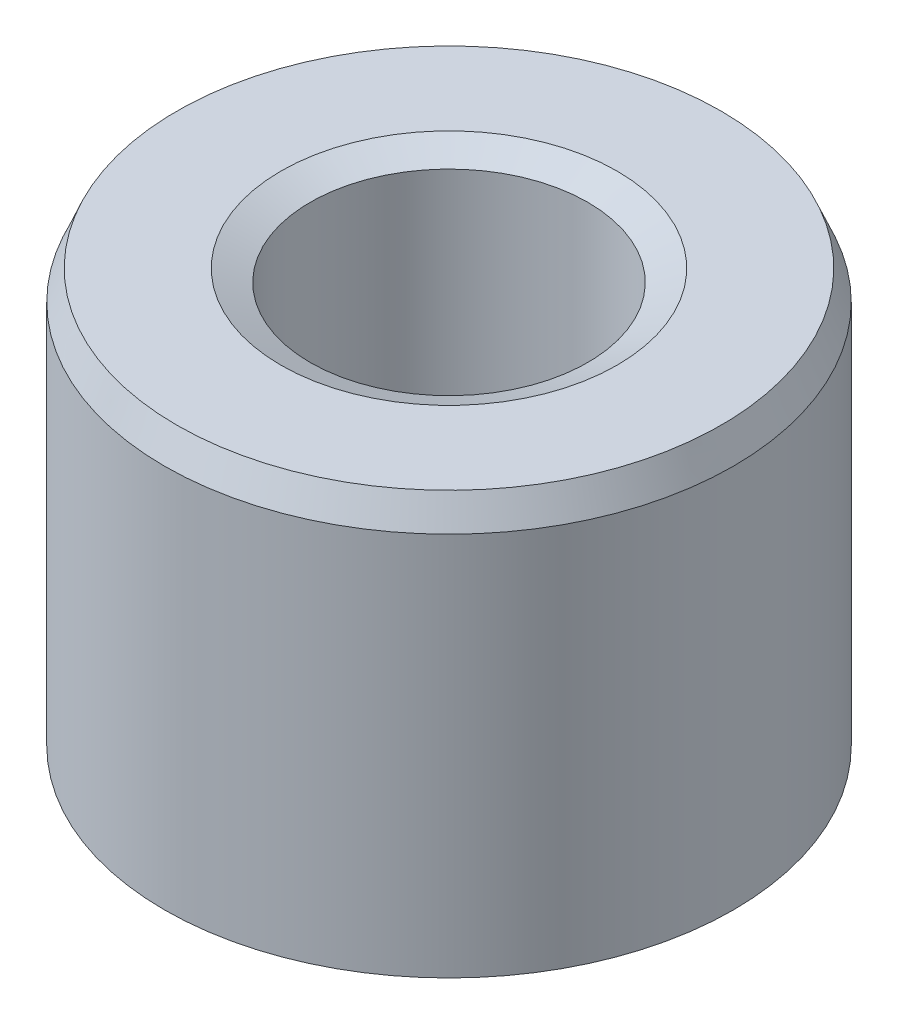
ISO-10303-21;
HEADER;
FILE_DESCRIPTION(('STEP AP214'),'2;1');
FILE_NAME('part.step','',(''),(''),'','','');
FILE_SCHEMA(('AUTOMOTIVE_DESIGN { 1 0 10303 214 1 1 1 1 }'));
ENDSEC;
DATA;
#1=APPLICATION_CONTEXT('core data for automotive mechanical design processes');
#2=APPLICATION_PROTOCOL_DEFINITION('international standard','automotive_design',2000,#1);
#3=PRODUCT_CONTEXT('',#1,'mechanical');
#4=PRODUCT('Part','Part','',(#3));
#5=PRODUCT_RELATED_PRODUCT_CATEGORY('part','',(#4));
#6=PRODUCT_DEFINITION_FORMATION('','',#4);
#7=PRODUCT_DEFINITION_CONTEXT('part definition',#1,'design');
#8=PRODUCT_DEFINITION('design','',#6,#7);
#9=PRODUCT_DEFINITION_SHAPE('','',#8);
#10=(LENGTH_UNIT() NAMED_UNIT(*) SI_UNIT(.MILLI.,.METRE.));
#11=(NAMED_UNIT(*) PLANE_ANGLE_UNIT() SI_UNIT($,.RADIAN.));
#12=(NAMED_UNIT(*) SI_UNIT($,.STERADIAN.) SOLID_ANGLE_UNIT());
#13=UNCERTAINTY_MEASURE_WITH_UNIT(LENGTH_MEASURE(1.E-05),#10,'distance_accuracy_value','');
#14=(GEOMETRIC_REPRESENTATION_CONTEXT(3) GLOBAL_UNCERTAINTY_ASSIGNED_CONTEXT((#13)) GLOBAL_UNIT_ASSIGNED_CONTEXT((#10,
#11,#12)) REPRESENTATION_CONTEXT('',''));
#15=CARTESIAN_POINT('',(0.,0.,0.));
#16=DIRECTION('',(0.,0.,1.));
#17=DIRECTION('',(1.,0.,0.));
#18=AXIS2_PLACEMENT_3D('',#15,#16,#17);
#19=CARTESIAN_POINT('',(0.,48.6723369517639,0.));
#20=DIRECTION('',(0.,-1.,0.));
#21=DIRECTION('',(0.,0.,-1.));
#22=AXIS2_PLACEMENT_3D('',#19,#20,#21);
#23=CYLINDRICAL_SURFACE('',#22,32.5);
#24=CARTESIAN_POINT('',(0.,1.40936062844039,0.));
#25=DIRECTION('',(0.,1.,0.));
#26=DIRECTION('',(0.,0.,1.));
#27=AXIS2_PLACEMENT_3D('',#24,#25,#26);
#28=CIRCLE('',#27,32.5);
#29=CARTESIAN_POINT('',(0.,1.40936062844039,32.5));
#30=VERTEX_POINT('',#29);
#31=EDGE_CURVE('E10',#30,#30,#28,.T.);
#32=ORIENTED_EDGE('',*,*,#31,.T.);
#33=EDGE_LOOP('',(#32));
#34=FACE_BOUND('',#33,.T.);
#35=CARTESIAN_POINT('',(0.,45.3225189584579,0.));
#36=DIRECTION('',(0.,1.,0.));
#37=DIRECTION('',(0.,0.,1.));
#38=AXIS2_PLACEMENT_3D('',#35,#36,#37);
#39=CIRCLE('',#38,32.5);
#40=CARTESIAN_POINT('',(0.,45.3225189584579,-32.5));
#41=VERTEX_POINT('',#40);
#42=EDGE_CURVE('E50',#41,#41,#39,.F.);
#43=ORIENTED_EDGE('',*,*,#42,.T.);
#44=EDGE_LOOP('',(#43));
#45=FACE_BOUND('',#44,.T.);
#46=ADVANCED_FACE('F39',(#34,#45),#23,.T.);
#47=CARTESIAN_POINT('',(0.,48.6723369517639,0.));
#48=DIRECTION('',(0.,1.,0.));
#49=DIRECTION('',(0.,0.,1.));
#50=AXIS2_PLACEMENT_3D('',#47,#48,#49);
#51=PLANE('',#50);
#52=CARTESIAN_POINT('',(0.,48.6723369517639,0.));
#53=DIRECTION('',(0.,1.,0.));
#54=DIRECTION('',(0.,0.,1.));
#55=AXIS2_PLACEMENT_3D('',#52,#53,#54);
#56=CIRCLE('',#55,19.2094748104352);
#57=CARTESIAN_POINT('',(0.,48.6723369517639,19.2094748104352));
#58=VERTEX_POINT('',#57);
#59=EDGE_CURVE('E58',#58,#58,#56,.F.);
#60=ORIENTED_EDGE('',*,*,#59,.T.);
#61=EDGE_LOOP('',(#60));
#62=FACE_BOUND('',#61,.T.);
#63=CARTESIAN_POINT('',(0.,48.6723369517639,0.));
#64=DIRECTION('',(0.,1.,0.));
#65=DIRECTION('',(0.,0.,1.));
#66=AXIS2_PLACEMENT_3D('',#63,#64,#65);
#67=CIRCLE('',#66,31.0906393715596);
#68=CARTESIAN_POINT('',(0.,48.6723369517639,-31.0906393715596));
#69=VERTEX_POINT('',#68);
#70=EDGE_CURVE('E61',#69,#69,#67,.T.);
#71=ORIENTED_EDGE('',*,*,#70,.T.);
#72=EDGE_LOOP('',(#71));
#73=FACE_BOUND('',#72,.T.);
#74=ADVANCED_FACE('F88',(#62,#73),#51,.T.);
#75=CARTESIAN_POINT('',(0.,0.,0.));
#76=DIRECTION('',(0.,1.,0.));
#77=DIRECTION('',(0.,0.,1.));
#78=AXIS2_PLACEMENT_3D('',#75,#76,#77);
#79=PLANE('',#78);
#80=CARTESIAN_POINT('',(0.,0.,0.));
#81=DIRECTION('',(0.,1.,0.));
#82=DIRECTION('',(0.,0.,1.));
#83=AXIS2_PLACEMENT_3D('',#80,#81,#82);
#84=CIRCLE('',#83,17.2690174455696);
#85=CARTESIAN_POINT('',(0.,0.,17.2690174455696));
#86=VERTEX_POINT('',#85);
#87=EDGE_CURVE('E51',#86,#86,#84,.T.);
#88=ORIENTED_EDGE('',*,*,#87,.T.);
#89=EDGE_LOOP('',(#88));
#90=FACE_BOUND('',#89,.T.);
#91=CARTESIAN_POINT('',(0.,0.,0.));
#92=DIRECTION('',(0.,1.,0.));
#93=DIRECTION('',(0.,0.,1.));
#94=AXIS2_PLACEMENT_3D('',#91,#92,#93);
#95=CIRCLE('',#94,29.150182006694);
#96=CARTESIAN_POINT('',(0.,0.,29.150182006694));
#97=VERTEX_POINT('',#96);
#98=EDGE_CURVE('E54',#97,#97,#95,.F.);
#99=ORIENTED_EDGE('',*,*,#98,.T.);
#100=EDGE_LOOP('',(#99));
#101=FACE_BOUND('',#100,.T.);
#102=ADVANCED_FACE('F83',(#90,#101),#79,.F.);
#103=CARTESIAN_POINT('',(0.,48.6723369517639,0.));
#104=DIRECTION('',(0.,-1.,0.));
#105=DIRECTION('',(0.,0.,-1.));
#106=AXIS2_PLACEMENT_3D('',#103,#104,#105);
#107=CYLINDRICAL_SURFACE('',#106,15.8596568171292);
#108=CARTESIAN_POINT('',(0.,47.2629763233235,0.));
#109=DIRECTION('',(0.,1.,0.));
#110=DIRECTION('',(0.,0.,1.));
#111=AXIS2_PLACEMENT_3D('',#108,#109,#110);
#112=CIRCLE('',#111,15.8596568171292);
#113=CARTESIAN_POINT('',(0.,47.2629763233235,15.8596568171292));
#114=VERTEX_POINT('',#113);
#115=EDGE_CURVE('E67',#114,#114,#112,.T.);
#116=ORIENTED_EDGE('',*,*,#115,.T.);
#117=EDGE_LOOP('',(#116));
#118=FACE_BOUND('',#117,.T.);
#119=CARTESIAN_POINT('',(0.,3.34981799330597,0.));
#120=DIRECTION('',(0.,1.,0.));
#121=DIRECTION('',(0.,0.,1.));
#122=AXIS2_PLACEMENT_3D('',#119,#120,#121);
#123=CIRCLE('',#122,15.8596568171292);
#124=CARTESIAN_POINT('',(0.,3.34981799330597,15.8596568171292));
#125=VERTEX_POINT('',#124);
#126=EDGE_CURVE('E69',#125,#125,#123,.F.);
#127=ORIENTED_EDGE('',*,*,#126,.T.);
#128=EDGE_LOOP('',(#127));
#129=FACE_BOUND('',#128,.T.);
#130=ADVANCED_FACE('F71',(#118,#129),#107,.F.);
#131=CARTESIAN_POINT('',(0.,47.2629763233235,0.));
#132=DIRECTION('',(0.,1.,0.));
#133=DIRECTION('',(0.,0.,1.));
#134=AXIS2_PLACEMENT_3D('',#131,#132,#133);
#135=CONICAL_SURFACE('',#134,15.8596568171292,1.17255006387633);
#136=CARTESIAN_POINT('',(0.,48.6723369517639,19.2094748104352));
#137=CARTESIAN_POINT('',(0.,48.6576561118843,19.1745808730049));
#138=CARTESIAN_POINT('',(0.,48.6429752720047,19.1396869355746));
#139=CARTESIAN_POINT('',(0.,48.6136135922455,19.0698990607141));
#140=CARTESIAN_POINT('',(0.,48.5989327523659,19.0350051232838));
#141=CARTESIAN_POINT('',(0.,48.5695710726068,18.9652172484233));
#142=CARTESIAN_POINT('',(0.,48.5548902327272,18.930323310993));
#143=CARTESIAN_POINT('',(0.,48.525528552968,18.8605354361325));
#144=CARTESIAN_POINT('',(0.,48.5108477130884,18.8256414987022));
#145=CARTESIAN_POINT('',(0.,48.4814860333292,18.7558536238417));
#146=CARTESIAN_POINT('',(0.,48.4668051934497,18.7209596864114));
#147=CARTESIAN_POINT('',(0.,48.4374435136905,18.6511718115509));
#148=CARTESIAN_POINT('',(0.,48.4227626738109,18.6162778741206));
#149=CARTESIAN_POINT('',(0.,48.3934009940517,18.5464899992601));
#150=CARTESIAN_POINT('',(0.,48.3787201541721,18.5115960618298));
#151=CARTESIAN_POINT('',(0.,48.349358474413,18.4418081869692));
#152=CARTESIAN_POINT('',(0.,48.3346776345334,18.406914249539));
#153=CARTESIAN_POINT('',(0.,48.3053159547742,18.3371263746784));
#154=CARTESIAN_POINT('',(0.,48.2906351148946,18.3022324372482));
#155=CARTESIAN_POINT('',(0.,48.2612734351354,18.2324445623876));
#156=CARTESIAN_POINT('',(0.,48.2465925952558,18.1975506249574));
#157=CARTESIAN_POINT('',(0.,48.2172309154967,18.1277627500968));
#158=CARTESIAN_POINT('',(0.,48.2025500756171,18.0928688126665));
#159=CARTESIAN_POINT('',(0.,48.1731883958579,18.023080937806));
#160=CARTESIAN_POINT('',(0.,48.1585075559783,17.9881870003757));
#161=CARTESIAN_POINT('',(0.,48.1291458762191,17.9183991255152));
#162=CARTESIAN_POINT('',(0.,48.1144650363396,17.8835051880849));
#163=CARTESIAN_POINT('',(0.,48.0851033565804,17.8137173132244));
#164=CARTESIAN_POINT('',(0.,48.0704225167008,17.7788233757941));
#165=CARTESIAN_POINT('',(0.,48.0410608369416,17.7090355009336));
#166=CARTESIAN_POINT('',(0.,48.026379997062,17.6741415635033));
#167=CARTESIAN_POINT('',(0.,47.9970183173029,17.6043536886428));
#168=CARTESIAN_POINT('',(0.,47.9823374774233,17.5694597512125));
#169=CARTESIAN_POINT('',(0.,47.9529757976641,17.4996718763519));
#170=CARTESIAN_POINT('',(0.,47.9382949577845,17.4647779389217));
#171=CARTESIAN_POINT('',(0.,47.9089332780253,17.3949900640611));
#172=CARTESIAN_POINT('',(0.,47.8942524381457,17.3600961266309));
#173=CARTESIAN_POINT('',(0.,47.8648907583866,17.2903082517703));
#174=CARTESIAN_POINT('',(0.,47.850209918507,17.2554143143401));
#175=CARTESIAN_POINT('',(0.,47.8208482387478,17.1856264394795));
#176=CARTESIAN_POINT('',(0.,47.8061673988682,17.1507325020492));
#177=CARTESIAN_POINT('',(0.,47.7768057191091,17.0809446271887));
#178=CARTESIAN_POINT('',(0.,47.7621248792295,17.0460506897584));
#179=CARTESIAN_POINT('',(0.,47.7327631994703,16.9762628148979));
#180=CARTESIAN_POINT('',(0.,47.7180823595907,16.9413688774676));
#181=CARTESIAN_POINT('',(0.,47.6887206798315,16.8715810026071));
#182=CARTESIAN_POINT('',(0.,47.6740398399519,16.8366870651768));
#183=CARTESIAN_POINT('',(0.,47.6446781601928,16.7668991903163));
#184=CARTESIAN_POINT('',(0.,47.6299973203132,16.732005252886));
#185=CARTESIAN_POINT('',(0.,47.600635640554,16.6622173780255));
#186=CARTESIAN_POINT('',(0.,47.5859548006744,16.6273234405952));
#187=CARTESIAN_POINT('',(0.,47.5565931209152,16.5575355657346));
#188=CARTESIAN_POINT('',(0.,47.5419122810356,16.5226416283044));
#189=CARTESIAN_POINT('',(0.,47.5125506012765,16.4528537534438));
#190=CARTESIAN_POINT('',(0.,47.4978697613969,16.4179598160136));
#191=CARTESIAN_POINT('',(0.,47.4685080816377,16.348171941153));
#192=CARTESIAN_POINT('',(0.,47.4538272417581,16.3132780037228));
#193=CARTESIAN_POINT('',(0.,47.424465561999,16.2434901288622));
#194=CARTESIAN_POINT('',(0.,47.4097847221194,16.2085961914319));
#195=CARTESIAN_POINT('',(0.,47.3804230423602,16.1388083165714));
#196=CARTESIAN_POINT('',(0.,47.3657422024806,16.1039143791411));
#197=CARTESIAN_POINT('',(0.,47.3363805227214,16.0341265042806));
#198=CARTESIAN_POINT('',(0.,47.3216996828418,15.9992325668503));
#199=CARTESIAN_POINT('',(0.,47.2923380030827,15.9294446919898));
#200=CARTESIAN_POINT('',(0.,47.2776571632031,15.8945507545595));
#201=CARTESIAN_POINT('',(0.,47.2629763233235,15.8596568171292));
#202=B_SPLINE_CURVE_WITH_KNOTS('',3,(#136,#137,#138,#139,#140,#141,#142,#143,#144,#145,#146,
#147,#148,#149,#150,#151,#152,#153,#154,#155,#156,#157,#158,#159,#160,#161,#162,#163,#164,#165,
#166,#167,#168,#169,#170,#171,#172,#173,#174,#175,#176,#177,#178,#179,#180,#181,#182,#183,#184,
#185,#186,#187,#188,#189,#190,#191,#192,#193,#194,#195,#196,#197,#198,#199,#200,#201),
.UNSPECIFIED.,.F.,.F.,(4,2,2,2,2,2,2,2,2,2,2,2,2,2,2,2,2,2,2,2,2,2,2,2,2,2,2,2,2,2,2,2,4),(0.,
0.113569473718157,0.227138947436318,0.340708421154475,0.45427789487263,0.567847368590787,
0.681416842308948,0.794986316027105,0.90855578974526,1.02212526346342,1.13569473718158,
1.24926421089973,1.36283368461789,1.47640315833605,1.58997263205421,1.70354210577236,
1.81711157949052,1.93068105320868,2.04425052692684,2.157820000645,2.27138947436315,
2.38495894808131,2.49852842179947,2.61209789551763,2.72566736923578,2.83923684295394,
2.9528063166721,3.06637579039026,3.17994526410841,3.29351473782657,3.40708421154473,
3.52065368526289,3.63422315898104),.UNSPECIFIED.);
#203=EDGE_CURVE('BSEAM77',#58,#114,#202,.T.);
#204=ORIENTED_EDGE('',*,*,#59,.F.);
#205=ORIENTED_EDGE('',*,*,#115,.F.);
#206=ORIENTED_EDGE('',*,*,#203,.T.);
#207=ORIENTED_EDGE('',*,*,#203,.F.);
#208=EDGE_LOOP('',(#204,#206,#205,#207));
#209=FACE_BOUND('',#208,.T.);
#210=ADVANCED_FACE('F77',(#209),#135,.F.);
#211=CARTESIAN_POINT('',(0.,0.,0.));
#212=DIRECTION('',(0.,-1.,0.));
#213=DIRECTION('',(0.,0.,-1.));
#214=AXIS2_PLACEMENT_3D('',#211,#212,#213);
#215=CONICAL_SURFACE('',#214,17.2690174455696,0.398246262918572);
#216=ORIENTED_EDGE('',*,*,#126,.F.);
#217=EDGE_LOOP('',(#216));
#218=FACE_BOUND('',#217,.T.);
#219=ORIENTED_EDGE('',*,*,#87,.F.);
#220=EDGE_LOOP('',(#219));
#221=FACE_BOUND('',#220,.T.);
#222=ADVANCED_FACE('F73',(#218,#221),#215,.F.);
#223=CARTESIAN_POINT('',(0.,1.40936062844039,0.));
#224=DIRECTION('',(0.,1.,0.));
#225=DIRECTION('',(0.,0.,1.));
#226=AXIS2_PLACEMENT_3D('',#223,#224,#225);
#227=CONICAL_SURFACE('',#226,32.5,1.17255006387633);
#228=ORIENTED_EDGE('',*,*,#98,.F.);
#229=EDGE_LOOP('',(#228));
#230=FACE_BOUND('',#229,.T.);
#231=ORIENTED_EDGE('',*,*,#31,.F.);
#232=EDGE_LOOP('',(#231));
#233=FACE_BOUND('',#232,.T.);
#234=ADVANCED_FACE('F76',(#230,#233),#227,.T.);
#235=CARTESIAN_POINT('',(0.,48.6723369517639,0.));
#236=DIRECTION('',(0.,-1.,0.));
#237=DIRECTION('',(0.,0.,-1.));
#238=AXIS2_PLACEMENT_3D('',#235,#236,#237);
#239=CONICAL_SURFACE('',#238,31.0906393715596,0.39824626291857);
#240=CARTESIAN_POINT('',(0.,45.3225189584579,-32.5));
#241=CARTESIAN_POINT('',(0.,45.3574128958882,-32.4853191601204));
#242=CARTESIAN_POINT('',(0.,45.3923068333185,-32.4706383202408));
#243=CARTESIAN_POINT('',(0.,45.462094708179,-32.4412766404817));
#244=CARTESIAN_POINT('',(0.,45.4969886456093,-32.4265958006021));
#245=CARTESIAN_POINT('',(0.,45.5667765204698,-32.3972341208429));
#246=CARTESIAN_POINT('',(0.,45.6016704579001,-32.3825532809633));
#247=CARTESIAN_POINT('',(0.,45.6714583327607,-32.3531916012041));
#248=CARTESIAN_POINT('',(0.,45.7063522701909,-32.3385107613245));
#249=CARTESIAN_POINT('',(0.,45.7761401450515,-32.3091490815654));
#250=CARTESIAN_POINT('',(0.,45.8110340824817,-32.2944682416858));
#251=CARTESIAN_POINT('',(0.,45.8808219573423,-32.2651065619266));
#252=CARTESIAN_POINT('',(0.,45.9157158947725,-32.250425722047));
#253=CARTESIAN_POINT('',(0.,45.9855037696331,-32.2210640422878));
#254=CARTESIAN_POINT('',(0.,46.0203977070634,-32.2063832024083));
#255=CARTESIAN_POINT('',(0.,46.0901855819239,-32.1770215226491));
#256=CARTESIAN_POINT('',(0.,46.1250795193542,-32.1623406827695));
#257=CARTESIAN_POINT('',(0.,46.1948673942147,-32.1329790030103));
#258=CARTESIAN_POINT('',(0.,46.229761331645,-32.1182981631307));
#259=CARTESIAN_POINT('',(0.,46.2995492065055,-32.0889364833716));
#260=CARTESIAN_POINT('',(0.,46.3344431439358,-32.074255643492));
#261=CARTESIAN_POINT('',(0.,46.4042310187963,-32.0448939637328));
#262=CARTESIAN_POINT('',(0.,46.4391249562266,-32.0302131238532));
#263=CARTESIAN_POINT('',(0.,46.5089128310871,-32.000851444094));
#264=CARTESIAN_POINT('',(0.,46.5438067685174,-31.9861706042145));
#265=CARTESIAN_POINT('',(0.,46.6135946433779,-31.9568089244553));
#266=CARTESIAN_POINT('',(0.,46.6484885808082,-31.9421280845757));
#267=CARTESIAN_POINT('',(0.,46.7182764556688,-31.9127664048165));
#268=CARTESIAN_POINT('',(0.,46.753170393099,-31.8980855649369));
#269=CARTESIAN_POINT('',(0.,46.8229582679596,-31.8687238851778));
#270=CARTESIAN_POINT('',(0.,46.8578522053898,-31.8540430452982));
#271=CARTESIAN_POINT('',(0.,46.9276400802504,-31.824681365539));
#272=CARTESIAN_POINT('',(0.,46.9625340176806,-31.8100005256594));
#273=CARTESIAN_POINT('',(0.,47.0323218925412,-31.7806388459002));
#274=CARTESIAN_POINT('',(0.,47.0672158299715,-31.7659580060206));
#275=CARTESIAN_POINT('',(0.,47.137003704832,-31.7365963262615));
#276=CARTESIAN_POINT('',(0.,47.1718976422623,-31.7219154863819));
#277=CARTESIAN_POINT('',(0.,47.2416855171228,-31.6925538066227));
#278=CARTESIAN_POINT('',(0.,47.2765794545531,-31.6778729667431));
#279=CARTESIAN_POINT('',(0.,47.3463673294136,-31.6485112869839));
#280=CARTESIAN_POINT('',(0.,47.3812612668439,-31.6338304471044));
#281=CARTESIAN_POINT('',(0.,47.4510491417044,-31.6044687673452));
#282=CARTESIAN_POINT('',(0.,47.4859430791347,-31.5897879274656));
#283=CARTESIAN_POINT('',(0.,47.5557309539952,-31.5604262477064));
#284=CARTESIAN_POINT('',(0.,47.5906248914255,-31.5457454078268));
#285=CARTESIAN_POINT('',(0.,47.660412766286,-31.5163837280677));
#286=CARTESIAN_POINT('',(0.,47.6953067037163,-31.5017028881881));
#287=CARTESIAN_POINT('',(0.,47.7650945785769,-31.4723412084289));
#288=CARTESIAN_POINT('',(0.,47.7999885160071,-31.4576603685493));
#289=CARTESIAN_POINT('',(0.,47.8697763908677,-31.4282986887901));
#290=CARTESIAN_POINT('',(0.,47.9046703282979,-31.4136178489105));
#291=CARTESIAN_POINT('',(0.,47.9744582031585,-31.3842561691514));
#292=CARTESIAN_POINT('',(0.,48.0093521405887,-31.3695753292718));
#293=CARTESIAN_POINT('',(0.,48.0791400154493,-31.3402136495126));
#294=CARTESIAN_POINT('',(0.,48.1140339528796,-31.325532809633));
#295=CARTESIAN_POINT('',(0.,48.1838218277401,-31.2961711298739));
#296=CARTESIAN_POINT('',(0.,48.2187157651704,-31.2814902899943));
#297=CARTESIAN_POINT('',(0.,48.2885036400309,-31.2521286102351));
#298=CARTESIAN_POINT('',(0.,48.3233975774612,-31.2374477703555));
#299=CARTESIAN_POINT('',(0.,48.3931854523217,-31.2080860905963));
#300=CARTESIAN_POINT('',(0.,48.428079389752,-31.1934052507167));
#301=CARTESIAN_POINT('',(0.,48.4978672646125,-31.1640435709576));
#302=CARTESIAN_POINT('',(0.,48.5327612020428,-31.149362731078));
#303=CARTESIAN_POINT('',(0.,48.6025490769033,-31.1200010513188));
#304=CARTESIAN_POINT('',(0.,48.6374430143336,-31.1053202114392));
#305=CARTESIAN_POINT('',(0.,48.6723369517639,-31.0906393715596));
#306=B_SPLINE_CURVE_WITH_KNOTS('',3,(#240,#241,#242,#243,#244,#245,#246,#247,#248,#249,#250,
#251,#252,#253,#254,#255,#256,#257,#258,#259,#260,#261,#262,#263,#264,#265,#266,#267,#268,#269,
#270,#271,#272,#273,#274,#275,#276,#277,#278,#279,#280,#281,#282,#283,#284,#285,#286,#287,#288,
#289,#290,#291,#292,#293,#294,#295,#296,#297,#298,#299,#300,#301,#302,#303,#304,#305),
.UNSPECIFIED.,.F.,.F.,(4,2,2,2,2,2,2,2,2,2,2,2,2,2,2,2,2,2,2,2,2,2,2,2,2,2,2,2,2,2,2,2,4),(0.,
0.113569473718154,0.227138947436312,0.340708421154466,0.454277894872627,0.567847368590778,
0.681416842308939,0.794986316027099,0.908555789745253,1.02212526346341,1.13569473718157,
1.24926421089973,1.36283368461788,1.47640315833604,1.58997263205419,1.70354210577235,
1.81711157949051,1.93068105320866,2.04425052692683,2.15782000064498,2.27138947436314,
2.38495894808129,2.49852842179945,2.6120978955176,2.72566736923576,2.83923684295392,
2.95280631667208,3.06637579039024,3.17994526410839,3.29351473782655,3.4070842115447,
3.52065368526286,3.63422315898102),.UNSPECIFIED.);
#307=EDGE_CURVE('BSEAM45',#41,#69,#306,.T.);
#308=ORIENTED_EDGE('',*,*,#42,.F.);
#309=ORIENTED_EDGE('',*,*,#70,.F.);
#310=ORIENTED_EDGE('',*,*,#307,.T.);
#311=ORIENTED_EDGE('',*,*,#307,.F.);
#312=EDGE_LOOP('',(#308,#310,#309,#311));
#313=FACE_BOUND('',#312,.T.);
#314=ADVANCED_FACE('F45',(#313),#239,.T.);
#315=CLOSED_SHELL('',(#46,#74,#102,#130,#210,#222,#234,#314));
#316=MANIFOLD_SOLID_BREP('B2',#315);
#317=ADVANCED_BREP_SHAPE_REPRESENTATION('',(#18,#316),#14);
#318=SHAPE_DEFINITION_REPRESENTATION(#9,#317);
ENDSEC;
END-ISO-10303-21;
